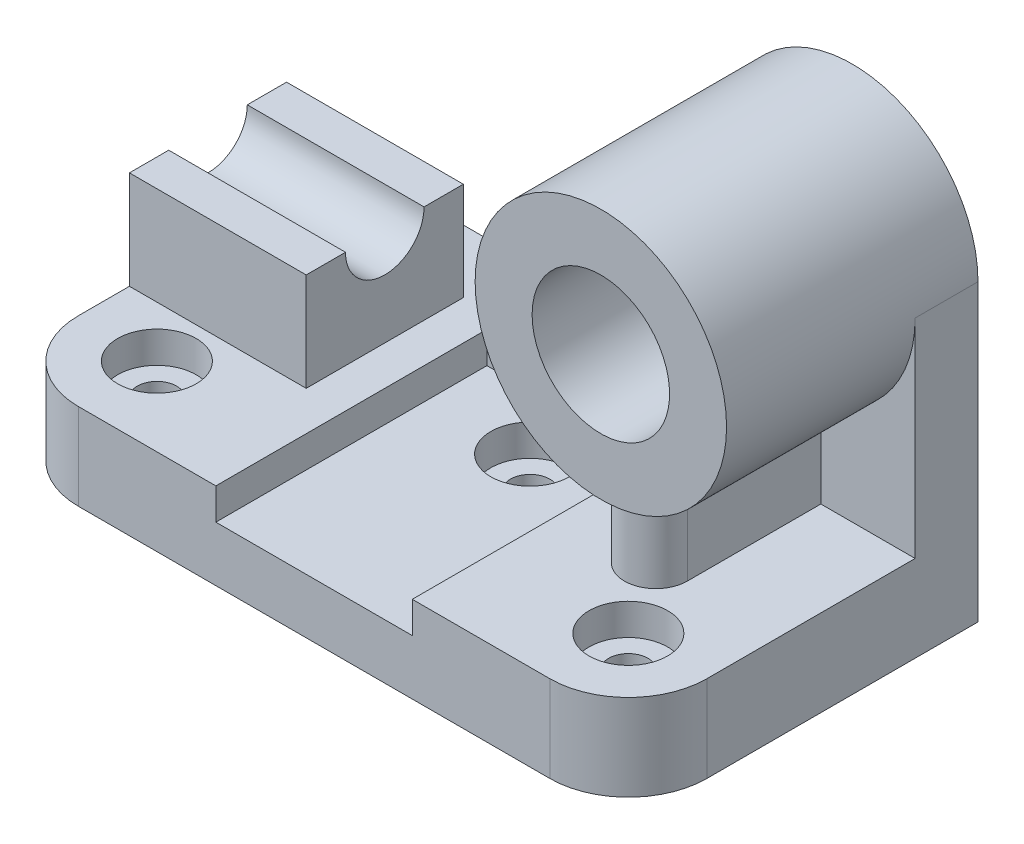
ISO-10303-21;
HEADER;
FILE_DESCRIPTION(('STEP AP214'),'2;1');
FILE_NAME('part.step','',(''),(''),'','','');
FILE_SCHEMA(('AUTOMOTIVE_DESIGN { 1 0 10303 214 1 1 1 1 }'));
ENDSEC;
DATA;
#1=APPLICATION_CONTEXT('core data for automotive mechanical design processes');
#2=APPLICATION_PROTOCOL_DEFINITION('international standard','automotive_design',2000,#1);
#3=PRODUCT_CONTEXT('',#1,'mechanical');
#4=PRODUCT('Part','Part','',(#3));
#5=PRODUCT_RELATED_PRODUCT_CATEGORY('part','',(#4));
#6=PRODUCT_DEFINITION_FORMATION('','',#4);
#7=PRODUCT_DEFINITION_CONTEXT('part definition',#1,'design');
#8=PRODUCT_DEFINITION('design','',#6,#7);
#9=PRODUCT_DEFINITION_SHAPE('','',#8);
#10=(LENGTH_UNIT() NAMED_UNIT(*) SI_UNIT(.MILLI.,.METRE.));
#11=(NAMED_UNIT(*) PLANE_ANGLE_UNIT() SI_UNIT($,.RADIAN.));
#12=(NAMED_UNIT(*) SI_UNIT($,.STERADIAN.) SOLID_ANGLE_UNIT());
#13=UNCERTAINTY_MEASURE_WITH_UNIT(LENGTH_MEASURE(1.E-05),#10,'distance_accuracy_value','');
#14=(GEOMETRIC_REPRESENTATION_CONTEXT(3) GLOBAL_UNCERTAINTY_ASSIGNED_CONTEXT((#13)) GLOBAL_UNIT_ASSIGNED_CONTEXT((#10,
#11,#12)) REPRESENTATION_CONTEXT('',''));
#15=CARTESIAN_POINT('',(0.,0.,0.));
#16=DIRECTION('',(0.,0.,1.));
#17=DIRECTION('',(1.,0.,0.));
#18=AXIS2_PLACEMENT_3D('',#15,#16,#17);
#19=CARTESIAN_POINT('',(0.,47.,0.));
#20=DIRECTION('',(0.,-1.,0.));
#21=DIRECTION('',(0.,0.,-1.));
#22=AXIS2_PLACEMENT_3D('',#19,#20,#21);
#23=PLANE('',#22);
#24=DIRECTION('',(0.,0.,1.));
#25=VECTOR('',#24,1.);
#26=CARTESIAN_POINT('',(0.,47.,-33.));
#27=LINE('',#26,#25);
#28=CARTESIAN_POINT('',(0.,47.,-73.));
#29=VERTEX_POINT('',#28);
#30=CARTESIAN_POINT('',(0.,47.,-63.));
#31=VERTEX_POINT('',#30);
#32=EDGE_CURVE('E210',#29,#31,#27,.T.);
#33=ORIENTED_EDGE('',*,*,#32,.T.);
#34=DIRECTION('',(1.,0.,0.));
#35=VECTOR('',#34,1.);
#36=CARTESIAN_POINT('',(45.,47.,-63.));
#37=LINE('',#36,#35);
#38=CARTESIAN_POINT('',(45.,47.,-63.));
#39=VERTEX_POINT('',#38);
#40=EDGE_CURVE('E13',#31,#39,#37,.T.);
#41=ORIENTED_EDGE('',*,*,#40,.T.);
#42=DIRECTION('',(0.,0.,-1.));
#43=VECTOR('',#42,1.);
#44=CARTESIAN_POINT('',(45.,47.,-73.));
#45=LINE('',#44,#43);
#46=CARTESIAN_POINT('',(45.,47.,-73.));
#47=VERTEX_POINT('',#46);
#48=EDGE_CURVE('E207',#39,#47,#45,.T.);
#49=ORIENTED_EDGE('',*,*,#48,.T.);
#50=DIRECTION('',(-1.,0.,0.));
#51=VECTOR('',#50,1.);
#52=CARTESIAN_POINT('',(0.,47.,-73.));
#53=LINE('',#52,#51);
#54=EDGE_CURVE('E218',#47,#29,#53,.T.);
#55=ORIENTED_EDGE('',*,*,#54,.T.);
#56=EDGE_LOOP('',(#33,#41,#49,#55));
#57=FACE_BOUND('',#56,.T.);
#58=ADVANCED_FACE('F44',(#57),#23,.F.);
#59=CARTESIAN_POINT('',(20.,22.,-20.));
#60=DIRECTION('',(0.,1.,0.));
#61=DIRECTION('',(0.,0.,1.));
#62=AXIS2_PLACEMENT_3D('',#59,#60,#61);
#63=PLANE('',#62);
#64=CARTESIAN_POINT('',(20.,22.,-20.));
#65=DIRECTION('',(0.,1.,0.));
#66=DIRECTION('',(0.,0.,1.));
#67=AXIS2_PLACEMENT_3D('',#64,#65,#66);
#68=CIRCLE('',#67,10.);
#69=CARTESIAN_POINT('',(20.,22.,-10.));
#70=VERTEX_POINT('',#69);
#71=EDGE_CURVE('E452',#70,#70,#68,.T.);
#72=ORIENTED_EDGE('',*,*,#71,.F.);
#73=EDGE_LOOP('',(#72));
#74=FACE_BOUND('',#73,.T.);
#75=CARTESIAN_POINT('',(140.,22.,-20.));
#76=DIRECTION('',(0.,1.,0.));
#77=DIRECTION('',(0.,0.,1.));
#78=AXIS2_PLACEMENT_3D('',#75,#76,#77);
#79=CIRCLE('',#78,10.);
#80=CARTESIAN_POINT('',(140.,22.,-9.99999999999999));
#81=VERTEX_POINT('',#80);
#82=EDGE_CURVE('E458',#81,#81,#79,.T.);
#83=ORIENTED_EDGE('',*,*,#82,.F.);
#84=EDGE_LOOP('',(#83));
#85=FACE_BOUND('',#84,.T.);
#86=DIRECTION('',(0.,0.,-1.));
#87=VECTOR('',#86,1.);
#88=CARTESIAN_POINT('',(45.,22.,-73.));
#89=LINE('',#88,#87);
#90=CARTESIAN_POINT('',(45.,22.,-33.));
#91=VERTEX_POINT('',#90);
#92=CARTESIAN_POINT('',(45.,22.,-73.));
#93=VERTEX_POINT('',#92);
#94=EDGE_CURVE('E67',#91,#93,#89,.T.);
#95=ORIENTED_EDGE('',*,*,#94,.F.);
#96=DIRECTION('',(1.,0.,0.));
#97=VECTOR('',#96,1.);
#98=CARTESIAN_POINT('',(45.,22.,-33.));
#99=LINE('',#98,#97);
#100=CARTESIAN_POINT('',(0.,22.,-33.));
#101=VERTEX_POINT('',#100);
#102=EDGE_CURVE('E224',#101,#91,#99,.T.);
#103=ORIENTED_EDGE('',*,*,#102,.F.);
#104=DIRECTION('',(0.,0.,1.));
#105=VECTOR('',#104,1.);
#106=CARTESIAN_POINT('',(0.,22.,-89.));
#107=LINE('',#106,#105);
#108=CARTESIAN_POINT('',(0.,22.,-20.));
#109=VERTEX_POINT('',#108);
#110=EDGE_CURVE('E368',#101,#109,#107,.T.);
#111=ORIENTED_EDGE('',*,*,#110,.T.);
#112=CARTESIAN_POINT('',(20.,22.,-20.));
#113=DIRECTION('',(0.,1.,0.));
#114=DIRECTION('',(0.,0.,1.));
#115=AXIS2_PLACEMENT_3D('',#112,#113,#114);
#116=CIRCLE('',#115,20.);
#117=CARTESIAN_POINT('',(20.,22.,0.));
#118=VERTEX_POINT('',#117);
#119=EDGE_CURVE('E372',#109,#118,#116,.T.);
#120=ORIENTED_EDGE('',*,*,#119,.T.);
#121=DIRECTION('',(1.,0.,0.));
#122=VECTOR('',#121,1.);
#123=CARTESIAN_POINT('',(20.,22.,0.));
#124=LINE('',#123,#122);
#125=CARTESIAN_POINT('',(55.,22.,0.));
#126=VERTEX_POINT('',#125);
#127=EDGE_CURVE('E393',#118,#126,#124,.T.);
#128=ORIENTED_EDGE('',*,*,#127,.T.);
#129=DIRECTION('',(0.,0.,1.));
#130=VECTOR('',#129,1.);
#131=CARTESIAN_POINT('',(55.,22.,0.));
#132=LINE('',#131,#130);
#133=CARTESIAN_POINT('',(55.,22.,-69.));
#134=VERTEX_POINT('',#133);
#135=EDGE_CURVE('E466',#134,#126,#132,.T.);
#136=ORIENTED_EDGE('',*,*,#135,.F.);
#137=DIRECTION('',(-1.,0.,0.));
#138=VECTOR('',#137,1.);
#139=CARTESIAN_POINT('',(55.,22.,-69.));
#140=LINE('',#139,#138);
#141=CARTESIAN_POINT('',(105.,22.,-69.));
#142=VERTEX_POINT('',#141);
#143=EDGE_CURVE('E441',#142,#134,#140,.T.);
#144=ORIENTED_EDGE('',*,*,#143,.F.);
#145=DIRECTION('',(0.,0.,-1.));
#146=VECTOR('',#145,1.);
#147=CARTESIAN_POINT('',(105.,22.,-69.));
#148=LINE('',#147,#146);
#149=CARTESIAN_POINT('',(105.,22.,0.));
#150=VERTEX_POINT('',#149);
#151=EDGE_CURVE('E436',#150,#142,#148,.T.);
#152=ORIENTED_EDGE('',*,*,#151,.F.);
#153=CARTESIAN_POINT('',(140.,22.,0.));
#154=VERTEX_POINT('',#153);
#155=EDGE_CURVE('E391',#150,#154,#124,.T.);
#156=ORIENTED_EDGE('',*,*,#155,.T.);
#157=CARTESIAN_POINT('',(140.,22.,-20.));
#158=DIRECTION('',(0.,1.,0.));
#159=DIRECTION('',(0.,0.,1.));
#160=AXIS2_PLACEMENT_3D('',#157,#158,#159);
#161=CIRCLE('',#160,20.);
#162=CARTESIAN_POINT('',(160.,22.,-20.));
#163=VERTEX_POINT('',#162);
#164=EDGE_CURVE('E401',#154,#163,#161,.T.);
#165=ORIENTED_EDGE('',*,*,#164,.T.);
#166=DIRECTION('',(0.,0.,-1.));
#167=VECTOR('',#166,1.);
#168=CARTESIAN_POINT('',(160.,22.,-20.));
#169=LINE('',#168,#167);
#170=CARTESIAN_POINT('',(160.,22.,-73.));
#171=VERTEX_POINT('',#170);
#172=EDGE_CURVE('E403',#163,#171,#169,.T.);
#173=ORIENTED_EDGE('',*,*,#172,.T.);
#174=DIRECTION('',(1.,0.,0.));
#175=VECTOR('',#174,1.);
#176=CARTESIAN_POINT('',(136.,22.,-73.));
#177=LINE('',#176,#175);
#178=CARTESIAN_POINT('',(136.,22.,-73.));
#179=VERTEX_POINT('',#178);
#180=EDGE_CURVE('E253',#179,#171,#177,.T.);
#181=ORIENTED_EDGE('',*,*,#180,.F.);
#182=DIRECTION('',(0.,0.,-1.));
#183=VECTOR('',#182,1.);
#184=CARTESIAN_POINT('',(136.,22.,-39.));
#185=LINE('',#184,#183);
#186=CARTESIAN_POINT('',(136.,22.,-39.));
#187=VERTEX_POINT('',#186);
#188=EDGE_CURVE('E256',#187,#179,#185,.T.);
#189=ORIENTED_EDGE('',*,*,#188,.F.);
#190=CARTESIAN_POINT('',(128.,22.,-39.));
#191=DIRECTION('',(0.,1.,0.));
#192=DIRECTION('',(0.,0.,1.));
#193=AXIS2_PLACEMENT_3D('',#190,#191,#192);
#194=CIRCLE('',#193,8.00000000000001);
#195=CARTESIAN_POINT('',(120.,22.,-39.));
#196=VERTEX_POINT('',#195);
#197=EDGE_CURVE('E260',#196,#187,#194,.T.);
#198=ORIENTED_EDGE('',*,*,#197,.F.);
#199=DIRECTION('',(0.,0.,1.));
#200=VECTOR('',#199,1.);
#201=CARTESIAN_POINT('',(120.,22.,-73.));
#202=LINE('',#201,#200);
#203=CARTESIAN_POINT('',(120.,22.,-73.));
#204=VERTEX_POINT('',#203);
#205=EDGE_CURVE('E263',#204,#196,#202,.T.);
#206=ORIENTED_EDGE('',*,*,#205,.F.);
#207=DIRECTION('',(1.,0.,0.));
#208=VECTOR('',#207,1.);
#209=CARTESIAN_POINT('',(96.,22.,-73.));
#210=LINE('',#209,#208);
#211=CARTESIAN_POINT('',(96.,22.,-73.));
#212=VERTEX_POINT('',#211);
#213=EDGE_CURVE('E266',#212,#204,#210,.T.);
#214=ORIENTED_EDGE('',*,*,#213,.F.);
#215=DIRECTION('',(0.,0.,1.));
#216=VECTOR('',#215,1.);
#217=CARTESIAN_POINT('',(96.,22.,-89.));
#218=LINE('',#217,#216);
#219=CARTESIAN_POINT('',(96.,22.,-89.));
#220=VERTEX_POINT('',#219);
#221=EDGE_CURVE('E269',#220,#212,#218,.T.);
#222=ORIENTED_EDGE('',*,*,#221,.F.);
#223=DIRECTION('',(-1.,0.,0.));
#224=VECTOR('',#223,1.);
#225=CARTESIAN_POINT('',(160.,22.,-89.));
#226=LINE('',#225,#224);
#227=CARTESIAN_POINT('',(0.,22.,-89.));
#228=VERTEX_POINT('',#227);
#229=EDGE_CURVE('E376',#220,#228,#226,.T.);
#230=ORIENTED_EDGE('',*,*,#229,.T.);
#231=CARTESIAN_POINT('',(0.,22.,-73.));
#232=VERTEX_POINT('',#231);
#233=EDGE_CURVE('E375',#228,#232,#107,.T.);
#234=ORIENTED_EDGE('',*,*,#233,.T.);
#235=DIRECTION('',(-1.,0.,0.));
#236=VECTOR('',#235,1.);
#237=CARTESIAN_POINT('',(0.,22.,-73.));
#238=LINE('',#237,#236);
#239=EDGE_CURVE('E227',#93,#232,#238,.T.);
#240=ORIENTED_EDGE('',*,*,#239,.F.);
#241=EDGE_LOOP('',(#95,#103,#111,#120,#128,#136,#144,#152,#156,#165,#173,#181,#189,#198,#206,
#214,#222,#230,#234,#240));
#242=FACE_BOUND('',#241,.T.);
#243=ADVANCED_FACE('F342',(#74,#85,#242),#63,.T.);
#244=CARTESIAN_POINT('',(80.,22.,-55.));
#245=DIRECTION('',(0.,-1.,0.));
#246=DIRECTION('',(0.,0.,-1.));
#247=AXIS2_PLACEMENT_3D('',#244,#245,#246);
#248=CYLINDRICAL_SURFACE('',#247,5.00000000000001);
#249=CARTESIAN_POINT('',(80.,0.,-55.));
#250=DIRECTION('',(0.,1.,0.));
#251=DIRECTION('',(0.,0.,1.));
#252=AXIS2_PLACEMENT_3D('',#249,#250,#251);
#253=CIRCLE('',#252,5.00000000000001);
#254=CARTESIAN_POINT('',(80.,0.,-50.));
#255=VERTEX_POINT('',#254);
#256=EDGE_CURVE('E433',#255,#255,#253,.T.);
#257=ORIENTED_EDGE('',*,*,#256,.F.);
#258=EDGE_LOOP('',(#257));
#259=FACE_BOUND('',#258,.T.);
#260=CARTESIAN_POINT('',(80.,6.,-55.));
#261=DIRECTION('',(0.,1.,0.));
#262=DIRECTION('',(0.,0.,1.));
#263=AXIS2_PLACEMENT_3D('',#260,#261,#262);
#264=CIRCLE('',#263,5.00000000000001);
#265=CARTESIAN_POINT('',(80.,6.,-50.));
#266=VERTEX_POINT('',#265);
#267=EDGE_CURVE('E434',#266,#266,#264,.T.);
#268=ORIENTED_EDGE('',*,*,#267,.T.);
#269=EDGE_LOOP('',(#268));
#270=FACE_BOUND('',#269,.T.);
#271=ADVANCED_FACE('F348',(#259,#270),#248,.F.);
#272=CARTESIAN_POINT('',(20.,22.,-20.));
#273=DIRECTION('',(0.,-1.,0.));
#274=DIRECTION('',(0.,0.,-1.));
#275=AXIS2_PLACEMENT_3D('',#272,#273,#274);
#276=CYLINDRICAL_SURFACE('',#275,5.);
#277=CARTESIAN_POINT('',(20.,0.,-20.));
#278=DIRECTION('',(0.,1.,0.));
#279=DIRECTION('',(0.,0.,1.));
#280=AXIS2_PLACEMENT_3D('',#277,#278,#279);
#281=CIRCLE('',#280,5.);
#282=CARTESIAN_POINT('',(20.,0.,-15.));
#283=VERTEX_POINT('',#282);
#284=EDGE_CURVE('E398',#283,#283,#281,.T.);
#285=ORIENTED_EDGE('',*,*,#284,.F.);
#286=EDGE_LOOP('',(#285));
#287=FACE_BOUND('',#286,.T.);
#288=CARTESIAN_POINT('',(20.,14.,-20.));
#289=DIRECTION('',(0.,1.,0.));
#290=DIRECTION('',(0.,0.,1.));
#291=AXIS2_PLACEMENT_3D('',#288,#289,#290);
#292=CIRCLE('',#291,5.);
#293=CARTESIAN_POINT('',(20.,14.,-15.));
#294=VERTEX_POINT('',#293);
#295=EDGE_CURVE('E429',#294,#294,#292,.T.);
#296=ORIENTED_EDGE('',*,*,#295,.T.);
#297=EDGE_LOOP('',(#296));
#298=FACE_BOUND('',#297,.T.);
#299=ADVANCED_FACE('F495',(#287,#298),#276,.F.);
#300=CARTESIAN_POINT('',(140.,22.,-20.));
#301=DIRECTION('',(0.,-1.,0.));
#302=DIRECTION('',(0.,0.,-1.));
#303=AXIS2_PLACEMENT_3D('',#300,#301,#302);
#304=CYLINDRICAL_SURFACE('',#303,4.99999999999999);
#305=CARTESIAN_POINT('',(140.,0.,-20.));
#306=DIRECTION('',(0.,1.,0.));
#307=DIRECTION('',(0.,0.,1.));
#308=AXIS2_PLACEMENT_3D('',#305,#306,#307);
#309=CIRCLE('',#308,4.99999999999999);
#310=CARTESIAN_POINT('',(140.,0.,-15.));
#311=VERTEX_POINT('',#310);
#312=EDGE_CURVE('E486',#311,#311,#309,.T.);
#313=ORIENTED_EDGE('',*,*,#312,.F.);
#314=EDGE_LOOP('',(#313));
#315=FACE_BOUND('',#314,.T.);
#316=CARTESIAN_POINT('',(140.,14.,-20.));
#317=DIRECTION('',(0.,1.,0.));
#318=DIRECTION('',(0.,0.,1.));
#319=AXIS2_PLACEMENT_3D('',#316,#317,#318);
#320=CIRCLE('',#319,4.99999999999999);
#321=CARTESIAN_POINT('',(140.,14.,-15.));
#322=VERTEX_POINT('',#321);
#323=EDGE_CURVE('E426',#322,#322,#320,.T.);
#324=ORIENTED_EDGE('',*,*,#323,.T.);
#325=EDGE_LOOP('',(#324));
#326=FACE_BOUND('',#325,.T.);
#327=ADVANCED_FACE('F498',(#315,#326),#304,.F.);
#328=CARTESIAN_POINT('',(20.,0.,-20.));
#329=DIRECTION('',(0.,1.,0.));
#330=DIRECTION('',(0.,0.,1.));
#331=AXIS2_PLACEMENT_3D('',#328,#329,#330);
#332=PLANE('',#331);
#333=CARTESIAN_POINT('',(20.,0.,-20.));
#334=DIRECTION('',(0.,1.,0.));
#335=DIRECTION('',(0.,0.,1.));
#336=AXIS2_PLACEMENT_3D('',#333,#334,#335);
#337=CIRCLE('',#336,20.);
#338=CARTESIAN_POINT('',(0.,0.,-20.));
#339=VERTEX_POINT('',#338);
#340=CARTESIAN_POINT('',(20.,0.,0.));
#341=VERTEX_POINT('',#340);
#342=EDGE_CURVE('E406',#339,#341,#337,.T.);
#343=ORIENTED_EDGE('',*,*,#342,.F.);
#344=DIRECTION('',(0.,0.,1.));
#345=VECTOR('',#344,1.);
#346=CARTESIAN_POINT('',(0.,0.,-89.));
#347=LINE('',#346,#345);
#348=CARTESIAN_POINT('',(0.,0.,-89.));
#349=VERTEX_POINT('',#348);
#350=EDGE_CURVE('E383',#349,#339,#347,.T.);
#351=ORIENTED_EDGE('',*,*,#350,.F.);
#352=DIRECTION('',(-1.,0.,0.));
#353=VECTOR('',#352,1.);
#354=CARTESIAN_POINT('',(160.,0.,-89.));
#355=LINE('',#354,#353);
#356=CARTESIAN_POINT('',(160.,0.,-89.));
#357=VERTEX_POINT('',#356);
#358=EDGE_CURVE('E395',#357,#349,#355,.T.);
#359=ORIENTED_EDGE('',*,*,#358,.F.);
#360=DIRECTION('',(0.,0.,-1.));
#361=VECTOR('',#360,1.);
#362=CARTESIAN_POINT('',(160.,0.,-20.));
#363=LINE('',#362,#361);
#364=CARTESIAN_POINT('',(160.,0.,-20.));
#365=VERTEX_POINT('',#364);
#366=EDGE_CURVE('E412',#365,#357,#363,.T.);
#367=ORIENTED_EDGE('',*,*,#366,.F.);
#368=CARTESIAN_POINT('',(140.,0.,-20.));
#369=DIRECTION('',(0.,1.,0.));
#370=DIRECTION('',(0.,0.,1.));
#371=AXIS2_PLACEMENT_3D('',#368,#369,#370);
#372=CIRCLE('',#371,20.);
#373=CARTESIAN_POINT('',(140.,0.,0.));
#374=VERTEX_POINT('',#373);
#375=EDGE_CURVE('E410',#374,#365,#372,.T.);
#376=ORIENTED_EDGE('',*,*,#375,.F.);
#377=DIRECTION('',(1.,0.,0.));
#378=VECTOR('',#377,1.);
#379=CARTESIAN_POINT('',(20.,0.,0.));
#380=LINE('',#379,#378);
#381=EDGE_CURVE('E408',#341,#374,#380,.T.);
#382=ORIENTED_EDGE('',*,*,#381,.F.);
#383=EDGE_LOOP('',(#343,#351,#359,#367,#376,#382));
#384=FACE_BOUND('',#383,.T.);
#385=ORIENTED_EDGE('',*,*,#284,.T.);
#386=EDGE_LOOP('',(#385));
#387=FACE_BOUND('',#386,.T.);
#388=ORIENTED_EDGE('',*,*,#312,.T.);
#389=EDGE_LOOP('',(#388));
#390=FACE_BOUND('',#389,.T.);
#391=ORIENTED_EDGE('',*,*,#256,.T.);
#392=EDGE_LOOP('',(#391));
#393=FACE_BOUND('',#392,.T.);
#394=ADVANCED_FACE('F493',(#384,#387,#390,#393),#332,.F.);
#395=CARTESIAN_POINT('',(20.,22.,-20.));
#396=DIRECTION('',(0.,-1.,0.));
#397=DIRECTION('',(0.,0.,-1.));
#398=AXIS2_PLACEMENT_3D('',#395,#396,#397);
#399=CYLINDRICAL_SURFACE('',#398,20.);
#400=ORIENTED_EDGE('',*,*,#342,.T.);
#401=DIRECTION('',(0.,-1.,0.));
#402=VECTOR('',#401,1.);
#403=CARTESIAN_POINT('',(20.,22.,0.));
#404=LINE('',#403,#402);
#405=EDGE_CURVE('E390',#118,#341,#404,.T.);
#406=ORIENTED_EDGE('',*,*,#405,.F.);
#407=ORIENTED_EDGE('',*,*,#119,.F.);
#408=DIRECTION('',(0.,-1.,0.));
#409=VECTOR('',#408,1.);
#410=CARTESIAN_POINT('',(0.,22.,-20.));
#411=LINE('',#410,#409);
#412=EDGE_CURVE('E379',#109,#339,#411,.T.);
#413=ORIENTED_EDGE('',*,*,#412,.T.);
#414=EDGE_LOOP('',(#400,#406,#407,#413));
#415=FACE_BOUND('',#414,.T.);
#416=ADVANCED_FACE('F46',(#415),#399,.T.);
#417=CARTESIAN_POINT('',(20.,22.,0.));
#418=DIRECTION('',(0.,0.,-1.));
#419=DIRECTION('',(-1.,0.,0.));
#420=AXIS2_PLACEMENT_3D('',#417,#418,#419);
#421=PLANE('',#420);
#422=DIRECTION('',(1.,0.,0.));
#423=VECTOR('',#422,1.);
#424=CARTESIAN_POINT('',(105.,14.,0.));
#425=LINE('',#424,#423);
#426=CARTESIAN_POINT('',(55.,14.,0.));
#427=VERTEX_POINT('',#426);
#428=CARTESIAN_POINT('',(105.,14.,0.));
#429=VERTEX_POINT('',#428);
#430=EDGE_CURVE('E462',#427,#429,#425,.T.);
#431=ORIENTED_EDGE('',*,*,#430,.F.);
#432=DIRECTION('',(0.,1.,0.));
#433=VECTOR('',#432,1.);
#434=CARTESIAN_POINT('',(55.,14.,0.));
#435=LINE('',#434,#433);
#436=EDGE_CURVE('E461',#427,#126,#435,.T.);
#437=ORIENTED_EDGE('',*,*,#436,.T.);
#438=ORIENTED_EDGE('',*,*,#127,.F.);
#439=ORIENTED_EDGE('',*,*,#405,.T.);
#440=ORIENTED_EDGE('',*,*,#381,.T.);
#441=DIRECTION('',(0.,-1.,0.));
#442=VECTOR('',#441,1.);
#443=CARTESIAN_POINT('',(140.,22.,0.));
#444=LINE('',#443,#442);
#445=EDGE_CURVE('E422',#154,#374,#444,.T.);
#446=ORIENTED_EDGE('',*,*,#445,.F.);
#447=ORIENTED_EDGE('',*,*,#155,.F.);
#448=DIRECTION('',(0.,1.,0.));
#449=VECTOR('',#448,1.);
#450=CARTESIAN_POINT('',(105.,14.,0.));
#451=LINE('',#450,#449);
#452=EDGE_CURVE('E473',#429,#150,#451,.T.);
#453=ORIENTED_EDGE('',*,*,#452,.F.);
#454=EDGE_LOOP('',(#431,#437,#438,#439,#440,#446,#447,#453));
#455=FACE_BOUND('',#454,.T.);
#456=ADVANCED_FACE('F566',(#455),#421,.F.);
#457=CARTESIAN_POINT('',(140.,22.,-20.));
#458=DIRECTION('',(0.,-1.,0.));
#459=DIRECTION('',(0.,0.,-1.));
#460=AXIS2_PLACEMENT_3D('',#457,#458,#459);
#461=CYLINDRICAL_SURFACE('',#460,20.);
#462=ORIENTED_EDGE('',*,*,#375,.T.);
#463=DIRECTION('',(0.,-1.,0.));
#464=VECTOR('',#463,1.);
#465=CARTESIAN_POINT('',(160.,22.,-20.));
#466=LINE('',#465,#464);
#467=EDGE_CURVE('E419',#163,#365,#466,.T.);
#468=ORIENTED_EDGE('',*,*,#467,.F.);
#469=ORIENTED_EDGE('',*,*,#164,.F.);
#470=ORIENTED_EDGE('',*,*,#445,.T.);
#471=EDGE_LOOP('',(#462,#468,#469,#470));
#472=FACE_BOUND('',#471,.T.);
#473=ADVANCED_FACE('F563',(#472),#461,.T.);
#474=CARTESIAN_POINT('',(160.,22.,-20.));
#475=DIRECTION('',(-1.,0.,0.));
#476=DIRECTION('',(0.,0.,1.));
#477=AXIS2_PLACEMENT_3D('',#474,#475,#476);
#478=PLANE('',#477);
#479=ORIENTED_EDGE('',*,*,#366,.T.);
#480=DIRECTION('',(0.,-1.,0.));
#481=VECTOR('',#480,1.);
#482=CARTESIAN_POINT('',(160.,22.,-89.));
#483=LINE('',#482,#481);
#484=CARTESIAN_POINT('',(160.,75.,-89.));
#485=VERTEX_POINT('',#484);
#486=EDGE_CURVE('E416',#485,#357,#483,.T.);
#487=ORIENTED_EDGE('',*,*,#486,.F.);
#488=DIRECTION('',(0.,0.,-1.));
#489=VECTOR('',#488,1.);
#490=CARTESIAN_POINT('',(160.,75.,-107.397420406071));
#491=LINE('',#490,#489);
#492=CARTESIAN_POINT('',(160.,75.,-73.));
#493=VERTEX_POINT('',#492);
#494=EDGE_CURVE('E273',#485,#493,#491,.F.);
#495=ORIENTED_EDGE('',*,*,#494,.T.);
#496=DIRECTION('',(0.,-1.,0.));
#497=VECTOR('',#496,1.);
#498=CARTESIAN_POINT('',(160.,107.002,-73.));
#499=LINE('',#498,#497);
#500=EDGE_CURVE('E257',#493,#171,#499,.T.);
#501=ORIENTED_EDGE('',*,*,#500,.T.);
#502=ORIENTED_EDGE('',*,*,#172,.F.);
#503=ORIENTED_EDGE('',*,*,#467,.T.);
#504=EDGE_LOOP('',(#479,#487,#495,#501,#502,#503));
#505=FACE_BOUND('',#504,.T.);
#506=ADVANCED_FACE('F559',(#505),#478,.F.);
#507=CARTESIAN_POINT('',(160.,22.,-89.));
#508=DIRECTION('',(0.,0.,1.));
#509=DIRECTION('',(1.,0.,0.));
#510=AXIS2_PLACEMENT_3D('',#507,#508,#509);
#511=PLANE('',#510);
#512=ORIENTED_EDGE('',*,*,#358,.T.);
#513=DIRECTION('',(0.,-1.,0.));
#514=VECTOR('',#513,1.);
#515=CARTESIAN_POINT('',(0.,22.,-89.));
#516=LINE('',#515,#514);
#517=EDGE_CURVE('E387',#228,#349,#516,.T.);
#518=ORIENTED_EDGE('',*,*,#517,.F.);
#519=ORIENTED_EDGE('',*,*,#229,.F.);
#520=DIRECTION('',(0.,-1.,0.));
#521=VECTOR('',#520,1.);
#522=CARTESIAN_POINT('',(96.,107.002,-89.));
#523=LINE('',#522,#521);
#524=CARTESIAN_POINT('',(96.,75.,-89.));
#525=VERTEX_POINT('',#524);
#526=EDGE_CURVE('E276',#525,#220,#523,.T.);
#527=ORIENTED_EDGE('',*,*,#526,.F.);
#528=CARTESIAN_POINT('',(128.,75.,-89.));
#529=DIRECTION('',(0.,0.,-1.));
#530=DIRECTION('',(-1.,0.,0.));
#531=AXIS2_PLACEMENT_3D('',#528,#529,#530);
#532=CIRCLE('',#531,32.);
#533=EDGE_CURVE('E249',#525,#485,#532,.T.);
#534=ORIENTED_EDGE('',*,*,#533,.T.);
#535=ORIENTED_EDGE('',*,*,#486,.T.);
#536=EDGE_LOOP('',(#512,#518,#519,#527,#534,#535));
#537=FACE_BOUND('',#536,.T.);
#538=CARTESIAN_POINT('',(128.,75.,-89.));
#539=DIRECTION('',(0.,0.,-1.));
#540=DIRECTION('',(-1.,0.,0.));
#541=AXIS2_PLACEMENT_3D('',#538,#539,#540);
#542=CIRCLE('',#541,17.5);
#543=CARTESIAN_POINT('',(110.5,75.,-89.));
#544=VERTEX_POINT('',#543);
#545=EDGE_CURVE('E246',#544,#544,#542,.T.);
#546=ORIENTED_EDGE('',*,*,#545,.F.);
#547=EDGE_LOOP('',(#546));
#548=FACE_BOUND('',#547,.T.);
#549=ADVANCED_FACE('F556',(#537,#548),#511,.F.);
#550=CARTESIAN_POINT('',(0.,22.,-89.));
#551=DIRECTION('',(1.,0.,0.));
#552=DIRECTION('',(0.,0.,-1.));
#553=AXIS2_PLACEMENT_3D('',#550,#551,#552);
#554=PLANE('',#553);
#555=CARTESIAN_POINT('',(0.,47.,-43.));
#556=VERTEX_POINT('',#555);
#557=CARTESIAN_POINT('',(0.,47.,-33.));
#558=VERTEX_POINT('',#557);
#559=EDGE_CURVE('E230',#556,#558,#27,.T.);
#560=ORIENTED_EDGE('',*,*,#559,.F.);
#561=CARTESIAN_POINT('',(0.,47.,-53.));
#562=DIRECTION('',(1.,0.,0.));
#563=DIRECTION('',(0.,0.,-1.));
#564=AXIS2_PLACEMENT_3D('',#561,#562,#563);
#565=CIRCLE('',#564,9.99999999999999);
#566=EDGE_CURVE('E59',#556,#31,#565,.T.);
#567=ORIENTED_EDGE('',*,*,#566,.T.);
#568=ORIENTED_EDGE('',*,*,#32,.F.);
#569=DIRECTION('',(0.,-1.,0.));
#570=VECTOR('',#569,1.);
#571=CARTESIAN_POINT('',(0.,47.,-73.));
#572=LINE('',#571,#570);
#573=EDGE_CURVE('E223',#29,#232,#572,.T.);
#574=ORIENTED_EDGE('',*,*,#573,.T.);
#575=ORIENTED_EDGE('',*,*,#233,.F.);
#576=ORIENTED_EDGE('',*,*,#517,.T.);
#577=ORIENTED_EDGE('',*,*,#350,.T.);
#578=ORIENTED_EDGE('',*,*,#412,.F.);
#579=ORIENTED_EDGE('',*,*,#110,.F.);
#580=DIRECTION('',(0.,-1.,0.));
#581=VECTOR('',#580,1.);
#582=CARTESIAN_POINT('',(0.,47.,-33.));
#583=LINE('',#582,#581);
#584=EDGE_CURVE('E237',#558,#101,#583,.T.);
#585=ORIENTED_EDGE('',*,*,#584,.F.);
#586=EDGE_LOOP('',(#560,#567,#568,#574,#575,#576,#577,#578,#579,#585));
#587=FACE_BOUND('',#586,.T.);
#588=ADVANCED_FACE('F380',(#587),#554,.F.);
#589=CARTESIAN_POINT('',(55.,14.,0.));
#590=DIRECTION('',(-1.,0.,0.));
#591=DIRECTION('',(0.,0.,1.));
#592=AXIS2_PLACEMENT_3D('',#589,#590,#591);
#593=PLANE('',#592);
#594=ORIENTED_EDGE('',*,*,#135,.T.);
#595=ORIENTED_EDGE('',*,*,#436,.F.);
#596=DIRECTION('',(0.,0.,1.));
#597=VECTOR('',#596,1.);
#598=CARTESIAN_POINT('',(55.,14.,0.));
#599=LINE('',#598,#597);
#600=CARTESIAN_POINT('',(55.,14.,-69.));
#601=VERTEX_POINT('',#600);
#602=EDGE_CURVE('E472',#601,#427,#599,.T.);
#603=ORIENTED_EDGE('',*,*,#602,.F.);
#604=DIRECTION('',(0.,1.,0.));
#605=VECTOR('',#604,1.);
#606=CARTESIAN_POINT('',(55.,14.,-69.));
#607=LINE('',#606,#605);
#608=EDGE_CURVE('E480',#601,#134,#607,.T.);
#609=ORIENTED_EDGE('',*,*,#608,.T.);
#610=EDGE_LOOP('',(#594,#595,#603,#609));
#611=FACE_BOUND('',#610,.T.);
#612=ADVANCED_FACE('F534',(#611),#593,.F.);
#613=CARTESIAN_POINT('',(55.,14.,-69.));
#614=DIRECTION('',(0.,0.,-1.));
#615=DIRECTION('',(-1.,0.,0.));
#616=AXIS2_PLACEMENT_3D('',#613,#614,#615);
#617=PLANE('',#616);
#618=ORIENTED_EDGE('',*,*,#143,.T.);
#619=ORIENTED_EDGE('',*,*,#608,.F.);
#620=DIRECTION('',(-1.,0.,0.));
#621=VECTOR('',#620,1.);
#622=CARTESIAN_POINT('',(55.,14.,-69.));
#623=LINE('',#622,#621);
#624=CARTESIAN_POINT('',(105.,14.,-69.));
#625=VERTEX_POINT('',#624);
#626=EDGE_CURVE('E469',#625,#601,#623,.T.);
#627=ORIENTED_EDGE('',*,*,#626,.F.);
#628=DIRECTION('',(0.,1.,0.));
#629=VECTOR('',#628,1.);
#630=CARTESIAN_POINT('',(105.,14.,-69.));
#631=LINE('',#630,#629);
#632=EDGE_CURVE('E482',#625,#142,#631,.T.);
#633=ORIENTED_EDGE('',*,*,#632,.T.);
#634=EDGE_LOOP('',(#618,#619,#627,#633));
#635=FACE_BOUND('',#634,.T.);
#636=ADVANCED_FACE('F537',(#635),#617,.F.);
#637=CARTESIAN_POINT('',(105.,14.,-69.));
#638=DIRECTION('',(1.,0.,0.));
#639=DIRECTION('',(0.,0.,-1.));
#640=AXIS2_PLACEMENT_3D('',#637,#638,#639);
#641=PLANE('',#640);
#642=ORIENTED_EDGE('',*,*,#151,.T.);
#643=ORIENTED_EDGE('',*,*,#632,.F.);
#644=DIRECTION('',(0.,0.,-1.));
#645=VECTOR('',#644,1.);
#646=CARTESIAN_POINT('',(105.,14.,-69.));
#647=LINE('',#646,#645);
#648=EDGE_CURVE('E465',#429,#625,#647,.T.);
#649=ORIENTED_EDGE('',*,*,#648,.F.);
#650=ORIENTED_EDGE('',*,*,#452,.T.);
#651=EDGE_LOOP('',(#642,#643,#649,#650));
#652=FACE_BOUND('',#651,.T.);
#653=ADVANCED_FACE('F529',(#652),#641,.F.);
#654=CARTESIAN_POINT('',(0.,14.,0.));
#655=DIRECTION('',(0.,-1.,0.));
#656=DIRECTION('',(0.,0.,-1.));
#657=AXIS2_PLACEMENT_3D('',#654,#655,#656);
#658=PLANE('',#657);
#659=CARTESIAN_POINT('',(80.,14.,-55.));
#660=DIRECTION('',(0.,1.,0.));
#661=DIRECTION('',(0.,0.,1.));
#662=AXIS2_PLACEMENT_3D('',#659,#660,#661);
#663=CIRCLE('',#662,9.99999999999999);
#664=CARTESIAN_POINT('',(80.,14.,-45.));
#665=VERTEX_POINT('',#664);
#666=EDGE_CURVE('E272',#665,#665,#663,.T.);
#667=ORIENTED_EDGE('',*,*,#666,.F.);
#668=EDGE_LOOP('',(#667));
#669=FACE_BOUND('',#668,.T.);
#670=ORIENTED_EDGE('',*,*,#430,.T.);
#671=ORIENTED_EDGE('',*,*,#648,.T.);
#672=ORIENTED_EDGE('',*,*,#626,.T.);
#673=ORIENTED_EDGE('',*,*,#602,.T.);
#674=EDGE_LOOP('',(#670,#671,#672,#673));
#675=FACE_BOUND('',#674,.T.);
#676=ADVANCED_FACE('F520',(#669,#675),#658,.F.);
#677=CARTESIAN_POINT('',(140.,14.,-20.));
#678=DIRECTION('',(0.,1.,0.));
#679=DIRECTION('',(0.,0.,1.));
#680=AXIS2_PLACEMENT_3D('',#677,#678,#679);
#681=CYLINDRICAL_SURFACE('',#680,10.);
#682=CARTESIAN_POINT('',(140.,14.,-20.));
#683=DIRECTION('',(0.,1.,0.));
#684=DIRECTION('',(0.,0.,1.));
#685=AXIS2_PLACEMENT_3D('',#682,#683,#684);
#686=CIRCLE('',#685,10.);
#687=CARTESIAN_POINT('',(140.,14.,-9.99999999999999));
#688=VERTEX_POINT('',#687);
#689=EDGE_CURVE('E455',#688,#688,#686,.T.);
#690=ORIENTED_EDGE('',*,*,#689,.F.);
#691=EDGE_LOOP('',(#690));
#692=FACE_BOUND('',#691,.T.);
#693=ORIENTED_EDGE('',*,*,#82,.T.);
#694=EDGE_LOOP('',(#693));
#695=FACE_BOUND('',#694,.T.);
#696=ADVANCED_FACE('F518',(#692,#695),#681,.F.);
#697=CARTESIAN_POINT('',(140.,14.,-20.));
#698=DIRECTION('',(0.,1.,0.));
#699=DIRECTION('',(0.,0.,1.));
#700=AXIS2_PLACEMENT_3D('',#697,#698,#699);
#701=PLANE('',#700);
#702=ORIENTED_EDGE('',*,*,#323,.F.);
#703=EDGE_LOOP('',(#702));
#704=FACE_BOUND('',#703,.T.);
#705=ORIENTED_EDGE('',*,*,#689,.T.);
#706=EDGE_LOOP('',(#705));
#707=FACE_BOUND('',#706,.T.);
#708=ADVANCED_FACE('F512',(#704,#707),#701,.T.);
#709=CARTESIAN_POINT('',(20.,14.,-20.));
#710=DIRECTION('',(0.,1.,0.));
#711=DIRECTION('',(0.,0.,1.));
#712=AXIS2_PLACEMENT_3D('',#709,#710,#711);
#713=CYLINDRICAL_SURFACE('',#712,10.);
#714=CARTESIAN_POINT('',(20.,14.,-20.));
#715=DIRECTION('',(0.,1.,0.));
#716=DIRECTION('',(0.,0.,1.));
#717=AXIS2_PLACEMENT_3D('',#714,#715,#716);
#718=CIRCLE('',#717,10.);
#719=CARTESIAN_POINT('',(20.,14.,-10.));
#720=VERTEX_POINT('',#719);
#721=EDGE_CURVE('E430',#720,#720,#718,.T.);
#722=ORIENTED_EDGE('',*,*,#721,.F.);
#723=EDGE_LOOP('',(#722));
#724=FACE_BOUND('',#723,.T.);
#725=ORIENTED_EDGE('',*,*,#71,.T.);
#726=EDGE_LOOP('',(#725));
#727=FACE_BOUND('',#726,.T.);
#728=ADVANCED_FACE('F506',(#724,#727),#713,.F.);
#729=CARTESIAN_POINT('',(20.,14.,-20.));
#730=DIRECTION('',(0.,1.,0.));
#731=DIRECTION('',(0.,0.,1.));
#732=AXIS2_PLACEMENT_3D('',#729,#730,#731);
#733=PLANE('',#732);
#734=ORIENTED_EDGE('',*,*,#295,.F.);
#735=EDGE_LOOP('',(#734));
#736=FACE_BOUND('',#735,.T.);
#737=ORIENTED_EDGE('',*,*,#721,.T.);
#738=EDGE_LOOP('',(#737));
#739=FACE_BOUND('',#738,.T.);
#740=ADVANCED_FACE('F502',(#736,#739),#733,.T.);
#741=CARTESIAN_POINT('',(80.,6.,-55.));
#742=DIRECTION('',(0.,1.,0.));
#743=DIRECTION('',(0.,0.,1.));
#744=AXIS2_PLACEMENT_3D('',#741,#742,#743);
#745=CYLINDRICAL_SURFACE('',#744,9.99999999999999);
#746=CARTESIAN_POINT('',(80.,6.,-55.));
#747=DIRECTION('',(0.,1.,0.));
#748=DIRECTION('',(0.,0.,1.));
#749=AXIS2_PLACEMENT_3D('',#746,#747,#748);
#750=CIRCLE('',#749,9.99999999999999);
#751=CARTESIAN_POINT('',(80.,6.,-45.));
#752=VERTEX_POINT('',#751);
#753=EDGE_CURVE('E437',#752,#752,#750,.T.);
#754=ORIENTED_EDGE('',*,*,#753,.F.);
#755=EDGE_LOOP('',(#754));
#756=FACE_BOUND('',#755,.T.);
#757=ORIENTED_EDGE('',*,*,#666,.T.);
#758=EDGE_LOOP('',(#757));
#759=FACE_BOUND('',#758,.T.);
#760=ADVANCED_FACE('F505',(#756,#759),#745,.F.);
#761=CARTESIAN_POINT('',(80.,6.,-55.));
#762=DIRECTION('',(0.,1.,0.));
#763=DIRECTION('',(0.,0.,1.));
#764=AXIS2_PLACEMENT_3D('',#761,#762,#763);
#765=PLANE('',#764);
#766=ORIENTED_EDGE('',*,*,#267,.F.);
#767=EDGE_LOOP('',(#766));
#768=FACE_BOUND('',#767,.T.);
#769=ORIENTED_EDGE('',*,*,#753,.T.);
#770=EDGE_LOOP('',(#769));
#771=FACE_BOUND('',#770,.T.);
#772=ADVANCED_FACE('F329',(#768,#771),#765,.T.);
#773=CARTESIAN_POINT('',(96.,107.002,-89.));
#774=DIRECTION('',(1.,0.,0.));
#775=DIRECTION('',(0.,0.,-1.));
#776=AXIS2_PLACEMENT_3D('',#773,#774,#775);
#777=PLANE('',#776);
#778=DIRECTION('',(0.,0.,-1.));
#779=VECTOR('',#778,1.);
#780=CARTESIAN_POINT('',(96.,75.,-107.397420406071));
#781=LINE('',#780,#779);
#782=CARTESIAN_POINT('',(96.,75.,-73.));
#783=VERTEX_POINT('',#782);
#784=EDGE_CURVE('E277',#525,#783,#781,.F.);
#785=ORIENTED_EDGE('',*,*,#784,.F.);
#786=ORIENTED_EDGE('',*,*,#526,.T.);
#787=ORIENTED_EDGE('',*,*,#221,.T.);
#788=DIRECTION('',(0.,-1.,0.));
#789=VECTOR('',#788,1.);
#790=CARTESIAN_POINT('',(96.,107.002,-73.));
#791=LINE('',#790,#789);
#792=EDGE_CURVE('E280',#783,#212,#791,.T.);
#793=ORIENTED_EDGE('',*,*,#792,.F.);
#794=EDGE_LOOP('',(#785,#786,#787,#793));
#795=FACE_BOUND('',#794,.T.);
#796=ADVANCED_FACE('F325',(#795),#777,.F.);
#797=CARTESIAN_POINT('',(96.,107.002,-73.));
#798=DIRECTION('',(0.,0.,-1.));
#799=DIRECTION('',(-1.,0.,0.));
#800=AXIS2_PLACEMENT_3D('',#797,#798,#799);
#801=PLANE('',#800);
#802=CARTESIAN_POINT('',(128.,75.,-73.));
#803=DIRECTION('',(0.,0.,-1.));
#804=DIRECTION('',(-1.,0.,0.));
#805=AXIS2_PLACEMENT_3D('',#802,#803,#804);
#806=CIRCLE('',#805,32.);
#807=CARTESIAN_POINT('',(120.,44.0161332303407,-73.));
#808=VERTEX_POINT('',#807);
#809=EDGE_CURVE('E299',#783,#808,#806,.F.);
#810=ORIENTED_EDGE('',*,*,#809,.F.);
#811=ORIENTED_EDGE('',*,*,#792,.T.);
#812=ORIENTED_EDGE('',*,*,#213,.T.);
#813=DIRECTION('',(0.,-1.,0.));
#814=VECTOR('',#813,1.);
#815=CARTESIAN_POINT('',(120.,107.002,-73.));
#816=LINE('',#815,#814);
#817=EDGE_CURVE('E283',#808,#204,#816,.T.);
#818=ORIENTED_EDGE('',*,*,#817,.F.);
#819=EDGE_LOOP('',(#810,#811,#812,#818));
#820=FACE_BOUND('',#819,.T.);
#821=ADVANCED_FACE('F328',(#820),#801,.F.);
#822=CARTESIAN_POINT('',(120.,107.002,-73.));
#823=DIRECTION('',(1.,0.,0.));
#824=DIRECTION('',(0.,0.,-1.));
#825=AXIS2_PLACEMENT_3D('',#822,#823,#824);
#826=PLANE('',#825);
#827=DIRECTION('',(0.,0.,-1.));
#828=VECTOR('',#827,1.);
#829=CARTESIAN_POINT('',(120.,44.0161332303407,-107.397420406071));
#830=LINE('',#829,#828);
#831=CARTESIAN_POINT('',(120.,44.0161332303407,-39.));
#832=VERTEX_POINT('',#831);
#833=EDGE_CURVE('E302',#808,#832,#830,.F.);
#834=ORIENTED_EDGE('',*,*,#833,.F.);
#835=ORIENTED_EDGE('',*,*,#817,.T.);
#836=ORIENTED_EDGE('',*,*,#205,.T.);
#837=DIRECTION('',(0.,-1.,0.));
#838=VECTOR('',#837,1.);
#839=CARTESIAN_POINT('',(120.,107.002,-39.));
#840=LINE('',#839,#838);
#841=EDGE_CURVE('E286',#832,#196,#840,.T.);
#842=ORIENTED_EDGE('',*,*,#841,.F.);
#843=EDGE_LOOP('',(#834,#835,#836,#842));
#844=FACE_BOUND('',#843,.T.);
#845=ADVANCED_FACE('F332',(#844),#826,.F.);
#846=CARTESIAN_POINT('',(128.,107.002,-39.));
#847=DIRECTION('',(0.,-1.,0.));
#848=DIRECTION('',(0.,0.,-1.));
#849=AXIS2_PLACEMENT_3D('',#846,#847,#848);
#850=CYLINDRICAL_SURFACE('',#849,8.00000000000001);
#851=CARTESIAN_POINT('',(120.,44.0161332303407,-39.));
#852=CARTESIAN_POINT('',(119.999971945566,44.0161587456746,-38.7787632793939));
#853=CARTESIAN_POINT('',(120.009176064831,44.0137645196395,-38.557535473152));
#854=CARTESIAN_POINT('',(120.045842310867,44.0043223033325,-38.1167341459232));
#855=CARTESIAN_POINT('',(120.073301365352,43.9972750961538,-37.8971603528554));
#856=CARTESIAN_POINT('',(120.146199191634,43.9787308558003,-37.4616585882652));
#857=CARTESIAN_POINT('',(120.191602336279,43.9672426410213,-37.2457242711686));
#858=CARTESIAN_POINT('',(120.300002890832,43.9401676916372,-36.8185811817318));
#859=CARTESIAN_POINT('',(120.363000542696,43.9245809006693,-36.6073724744208));
#860=CARTESIAN_POINT('',(120.506064323753,43.8897712214483,-36.191204452355));
#861=CARTESIAN_POINT('',(120.586125101168,43.8705494734963,-35.9862432010988));
#862=CARTESIAN_POINT('',(120.762745371193,43.8290139022865,-35.5837954015375));
#863=CARTESIAN_POINT('',(120.859310963568,43.8066989364312,-35.3863116498092));
#864=CARTESIAN_POINT('',(121.068219413401,43.7596114504408,-35.0001741347302));
#865=CARTESIAN_POINT('',(121.180562858629,43.7348388387613,-34.8115207006842));
#866=CARTESIAN_POINT('',(121.420246719391,43.68352091395,-34.4442414231035));
#867=CARTESIAN_POINT('',(121.547587799861,43.6569755222425,-34.2656160246922));
#868=CARTESIAN_POINT('',(121.819063644174,43.6022999736734,-33.9161090338005));
#869=CARTESIAN_POINT('',(121.963479658611,43.5741489065012,-33.7454491097791));
#870=CARTESIAN_POINT('',(122.266053298274,43.5175360184007,-33.4168340833016));
#871=CARTESIAN_POINT('',(122.424211093284,43.4890741936367,-33.258879137866));
#872=CARTESIAN_POINT('',(122.753260378166,43.432618312673,-32.9566872205935));
#873=CARTESIAN_POINT('',(122.924154062213,43.4046243380976,-32.8124526223269));
#874=CARTESIAN_POINT('',(123.277534787348,43.3498770188941,-32.5387095417601));
#875=CARTESIAN_POINT('',(123.46002151475,43.3231236407316,-32.4092006612744));
#876=CARTESIAN_POINT('',(123.838067466615,43.2712239960296,-32.1640813992573));
#877=CARTESIAN_POINT('',(124.033775424014,43.2461059150703,-32.048694268118));
#878=CARTESIAN_POINT('',(124.434486542919,43.1986195421176,-31.8348995954559));
#879=CARTESIAN_POINT('',(124.639486334742,43.1762502640207,-31.7364859597312));
#880=CARTESIAN_POINT('',(125.057417252549,43.1348890483568,-31.5573596954717));
#881=CARTESIAN_POINT('',(125.270348557584,43.1158971870896,-31.4766474668228));
#882=CARTESIAN_POINT('',(125.702600707962,43.0818398364785,-31.333594111353));
#883=CARTESIAN_POINT('',(125.921921404316,43.066774255662,-31.2712525565354));
#884=CARTESIAN_POINT('',(126.360837950093,43.0412689566384,-31.1665450539501));
#885=CARTESIAN_POINT('',(126.580338397818,43.0307417887522,-31.1238003648792));
#886=CARTESIAN_POINT('',(127.022311536688,43.0141746551767,-31.0568218767007));
#887=CARTESIAN_POINT('',(127.244784162794,43.0081345914602,-31.0325876732046));
#888=CARTESIAN_POINT('',(127.69103245733,43.0007135691066,-31.0028417489651));
#889=CARTESIAN_POINT('',(127.914807990918,42.9993321366233,-30.9973281240839));
#890=CARTESIAN_POINT('',(128.362012454294,43.0012665346051,-31.0050667288588));
#891=CARTESIAN_POINT('',(128.585441388351,43.0045823067546,-31.0183187255404));
#892=CARTESIAN_POINT('',(129.025299848157,43.015690144771,-31.0629646924678));
#893=CARTESIAN_POINT('',(129.24177403761,43.0233802543781,-31.0939455377458));
#894=CARTESIAN_POINT('',(129.671350605354,43.04295330281,-31.1734861779667));
#895=CARTESIAN_POINT('',(129.8844518186,43.0548376586974,-31.2220519142631));
#896=CARTESIAN_POINT('',(130.305662540343,43.0824741604892,-31.3363503165913));
#897=CARTESIAN_POINT('',(130.513773691212,43.0982250140932,-31.4020772472992));
#898=CARTESIAN_POINT('',(130.923753213755,43.1331831779633,-31.5502218929191));
#899=CARTESIAN_POINT('',(131.125619217958,43.1523917806589,-31.6326458502565));
#900=CARTESIAN_POINT('',(131.523424527648,43.1939341672797,-31.81433999981));
#901=CARTESIAN_POINT('',(131.71929718824,43.2162936282114,-31.9137501943813));
#902=CARTESIAN_POINT('',(132.102056502345,43.2634227888496,-32.1282260753892));
#903=CARTESIAN_POINT('',(132.28894003051,43.2881933179157,-32.2432971543186));
#904=CARTESIAN_POINT('',(132.652454257378,43.3394825314387,-32.4882640456984));
#905=CARTESIAN_POINT('',(132.829085464008,43.3660011291525,-32.6181591227818));
#906=CARTESIAN_POINT('',(133.171001561435,43.4200901205804,-32.8919145570327));
#907=CARTESIAN_POINT('',(133.336286227279,43.4476605351306,-33.0357751909403));
#908=CARTESIAN_POINT('',(133.658799968209,43.5038811250212,-33.3406231812446));
#909=CARTESIAN_POINT('',(133.815688273868,43.5325402875744,-33.5019696083228));
#910=CARTESIAN_POINT('',(134.115305846126,43.5893921585512,-33.8372902994758));
#911=CARTESIAN_POINT('',(134.258039783194,43.6175850182637,-34.0112603651376));
#912=CARTESIAN_POINT('',(134.528523162407,43.672736238438,-34.3708496345554));
#913=CARTESIAN_POINT('',(134.656262852307,43.6996937885844,-34.5564763006155));
#914=CARTESIAN_POINT('',(134.895698330954,43.7515704281195,-34.9379756220715));
#915=CARTESIAN_POINT('',(135.00740029329,43.7764903002966,-35.1338442950682));
#916=CARTESIAN_POINT('',(135.21459212256,43.8237105639007,-35.5357441597629));
#917=CARTESIAN_POINT('',(135.309983950954,43.8459948823799,-35.7418278179965));
#918=CARTESIAN_POINT('',(135.482970997092,43.8870918818635,-36.1615760894869));
#919=CARTESIAN_POINT('',(135.560573316533,43.9059059476291,-36.3752376381245));
#920=CARTESIAN_POINT('',(135.697315791513,43.9394737900286,-36.8084546453931));
#921=CARTESIAN_POINT('',(135.756475064174,43.954231769103,-37.0280037431212));
#922=CARTESIAN_POINT('',(135.855908198794,43.979243526647,-37.4714978826353));
#923=CARTESIAN_POINT('',(135.896190908396,43.989499415151,-37.6954408136009));
#924=CARTESIAN_POINT('',(135.951219137672,44.003568496023,-38.0996119568711));
#925=CARTESIAN_POINT('',(135.969517363243,44.0082740323944,-38.279334100168));
#926=CARTESIAN_POINT('',(135.993903011518,44.0145591208554,-38.6393658065201));
#927=CARTESIAN_POINT('',(136.00001019014,44.0161437304345,-38.819673944132));
#928=CARTESIAN_POINT('',(136.,44.0161332303407,-39.));
#929=B_SPLINE_CURVE_WITH_KNOTS('',3,(#851,#852,#853,#854,#855,#856,#857,#858,#859,#860,#861,
#862,#863,#864,#865,#866,#867,#868,#869,#870,#871,#872,#873,#874,#875,#876,#877,#878,#879,#880,
#881,#882,#883,#884,#885,#886,#887,#888,#889,#890,#891,#892,#893,#894,#895,#896,#897,#898,#899,
#900,#901,#902,#903,#904,#905,#906,#907,#908,#909,#910,#911,#912,#913,#914,#915,#916,#917,#918,
#919,#920,#921,#922,#923,#924,#925,#926,#927,#928),.UNSPECIFIED.,.F.,.F.,(4,2,2,2,2,2,2,2,2,2,2,
2,2,2,2,2,2,2,2,2,2,2,2,2,2,2,2,2,2,2,2,2,2,2,2,2,2,2,4),(0.,0.663492242718147,1.3268728486772,
1.98894290744276,2.65102207134128,3.31289388176715,3.9750108344816,4.6371524595565,
5.29932345249878,5.97452992833544,6.64974474775264,7.32507616525638,8.0003893173533,
8.68528336807454,9.36993099865024,10.0545940942498,10.7392412374304,11.4100321538689,
12.0808084154902,12.7515164479828,13.4222161537279,14.0778887695756,14.7337831225556,
15.3894585535827,16.0453795722886,16.7069934346389,17.3688356887732,18.0306451254832,
18.6924676792279,19.3722674614523,20.0518421807408,20.7318564740587,21.411608295633,
22.0953124116714,22.7787431110367,23.4614630273399,24.1438626247803,24.6855747194272,
25.2264082401834),.UNSPECIFIED.);
#930=CARTESIAN_POINT('',(136.,44.0161332303407,-39.));
#931=VERTEX_POINT('',#930);
#932=EDGE_CURVE('E305',#832,#931,#929,.T.);
#933=ORIENTED_EDGE('',*,*,#932,.F.);
#934=ORIENTED_EDGE('',*,*,#841,.T.);
#935=ORIENTED_EDGE('',*,*,#197,.T.);
#936=DIRECTION('',(0.,-1.,0.));
#937=VECTOR('',#936,1.);
#938=CARTESIAN_POINT('',(136.,107.002,-39.));
#939=LINE('',#938,#937);
#940=EDGE_CURVE('E289',#931,#187,#939,.T.);
#941=ORIENTED_EDGE('',*,*,#940,.F.);
#942=EDGE_LOOP('',(#933,#934,#935,#941));
#943=FACE_BOUND('',#942,.T.);
#944=ADVANCED_FACE('F316',(#943),#850,.T.);
#945=CARTESIAN_POINT('',(136.,107.002,-39.));
#946=DIRECTION('',(-1.,0.,0.));
#947=DIRECTION('',(0.,0.,1.));
#948=AXIS2_PLACEMENT_3D('',#945,#946,#947);
#949=PLANE('',#948);
#950=DIRECTION('',(0.,0.,-1.));
#951=VECTOR('',#950,1.);
#952=CARTESIAN_POINT('',(136.,44.0161332303407,-107.397420406071));
#953=LINE('',#952,#951);
#954=CARTESIAN_POINT('',(136.,44.0161332303407,-73.));
#955=VERTEX_POINT('',#954);
#956=EDGE_CURVE('E314',#931,#955,#953,.T.);
#957=ORIENTED_EDGE('',*,*,#956,.F.);
#958=ORIENTED_EDGE('',*,*,#940,.T.);
#959=ORIENTED_EDGE('',*,*,#188,.T.);
#960=DIRECTION('',(0.,-1.,0.));
#961=VECTOR('',#960,1.);
#962=CARTESIAN_POINT('',(136.,107.002,-73.));
#963=LINE('',#962,#961);
#964=EDGE_CURVE('E292',#955,#179,#963,.T.);
#965=ORIENTED_EDGE('',*,*,#964,.F.);
#966=EDGE_LOOP('',(#957,#958,#959,#965));
#967=FACE_BOUND('',#966,.T.);
#968=ADVANCED_FACE('F339',(#967),#949,.F.);
#969=CARTESIAN_POINT('',(136.,107.002,-73.));
#970=DIRECTION('',(0.,0.,-1.));
#971=DIRECTION('',(-1.,0.,0.));
#972=AXIS2_PLACEMENT_3D('',#969,#970,#971);
#973=PLANE('',#972);
#974=CARTESIAN_POINT('',(128.,75.,-73.));
#975=DIRECTION('',(0.,0.,-1.));
#976=DIRECTION('',(-1.,0.,0.));
#977=AXIS2_PLACEMENT_3D('',#974,#975,#976);
#978=CIRCLE('',#977,32.);
#979=EDGE_CURVE('E252',#955,#493,#978,.F.);
#980=ORIENTED_EDGE('',*,*,#979,.F.);
#981=ORIENTED_EDGE('',*,*,#964,.T.);
#982=ORIENTED_EDGE('',*,*,#180,.T.);
#983=ORIENTED_EDGE('',*,*,#500,.F.);
#984=EDGE_LOOP('',(#980,#981,#982,#983));
#985=FACE_BOUND('',#984,.T.);
#986=ADVANCED_FACE('F592',(#985),#973,.F.);
#987=CARTESIAN_POINT('',(128.,75.,-107.397420406071));
#988=DIRECTION('',(0.,0.,-1.));
#989=DIRECTION('',(-1.,0.,0.));
#990=AXIS2_PLACEMENT_3D('',#987,#988,#989);
#991=CYLINDRICAL_SURFACE('',#990,32.);
#992=ORIENTED_EDGE('',*,*,#494,.F.);
#993=ORIENTED_EDGE('',*,*,#533,.F.);
#994=ORIENTED_EDGE('',*,*,#784,.T.);
#995=ORIENTED_EDGE('',*,*,#809,.T.);
#996=ORIENTED_EDGE('',*,*,#833,.T.);
#997=ORIENTED_EDGE('',*,*,#932,.T.);
#998=ORIENTED_EDGE('',*,*,#956,.T.);
#999=ORIENTED_EDGE('',*,*,#979,.T.);
#1000=EDGE_LOOP('',(#992,#993,#994,#995,#996,#997,#998,#999));
#1001=FACE_BOUND('',#1000,.T.);
#1002=CARTESIAN_POINT('',(128.,75.,-25.));
#1003=DIRECTION('',(0.,0.,-1.));
#1004=DIRECTION('',(-1.,0.,0.));
#1005=AXIS2_PLACEMENT_3D('',#1002,#1003,#1004);
#1006=CIRCLE('',#1005,32.);
#1007=CARTESIAN_POINT('',(96.,75.,-25.));
#1008=VERTEX_POINT('',#1007);
#1009=EDGE_CURVE('E240',#1008,#1008,#1006,.T.);
#1010=ORIENTED_EDGE('',*,*,#1009,.T.);
#1011=EDGE_LOOP('',(#1010));
#1012=FACE_BOUND('',#1011,.T.);
#1013=ADVANCED_FACE('F323',(#1001,#1012),#991,.T.);
#1014=CARTESIAN_POINT('',(128.,75.,-107.397420406071));
#1015=DIRECTION('',(0.,0.,-1.));
#1016=DIRECTION('',(-1.,0.,0.));
#1017=AXIS2_PLACEMENT_3D('',#1014,#1015,#1016);
#1018=CYLINDRICAL_SURFACE('',#1017,17.5);
#1019=CARTESIAN_POINT('',(128.,75.,-25.));
#1020=DIRECTION('',(0.,0.,-1.));
#1021=DIRECTION('',(-1.,0.,0.));
#1022=AXIS2_PLACEMENT_3D('',#1019,#1020,#1021);
#1023=CIRCLE('',#1022,17.5);
#1024=CARTESIAN_POINT('',(110.5,75.,-25.));
#1025=VERTEX_POINT('',#1024);
#1026=EDGE_CURVE('E243',#1025,#1025,#1023,.T.);
#1027=ORIENTED_EDGE('',*,*,#1026,.F.);
#1028=EDGE_LOOP('',(#1027));
#1029=FACE_BOUND('',#1028,.T.);
#1030=ORIENTED_EDGE('',*,*,#545,.T.);
#1031=EDGE_LOOP('',(#1030));
#1032=FACE_BOUND('',#1031,.T.);
#1033=ADVANCED_FACE('F612',(#1029,#1032),#1018,.F.);
#1034=CARTESIAN_POINT('',(145.5,75.,-25.));
#1035=DIRECTION('',(0.,0.,-1.));
#1036=DIRECTION('',(-1.,0.,0.));
#1037=AXIS2_PLACEMENT_3D('',#1034,#1035,#1036);
#1038=PLANE('',#1037);
#1039=ORIENTED_EDGE('',*,*,#1009,.F.);
#1040=EDGE_LOOP('',(#1039));
#1041=FACE_BOUND('',#1040,.T.);
#1042=ORIENTED_EDGE('',*,*,#1026,.T.);
#1043=EDGE_LOOP('',(#1042));
#1044=FACE_BOUND('',#1043,.T.);
#1045=ADVANCED_FACE('F615',(#1041,#1044),#1038,.F.);
#1046=CARTESIAN_POINT('',(45.,47.,-33.));
#1047=DIRECTION('',(0.,0.,-1.));
#1048=DIRECTION('',(-1.,0.,0.));
#1049=AXIS2_PLACEMENT_3D('',#1046,#1047,#1048);
#1050=PLANE('',#1049);
#1051=ORIENTED_EDGE('',*,*,#102,.T.);
#1052=DIRECTION('',(0.,-1.,0.));
#1053=VECTOR('',#1052,1.);
#1054=CARTESIAN_POINT('',(45.,47.,-33.));
#1055=LINE('',#1054,#1053);
#1056=CARTESIAN_POINT('',(45.,47.,-33.));
#1057=VERTEX_POINT('',#1056);
#1058=EDGE_CURVE('E234',#1057,#91,#1055,.T.);
#1059=ORIENTED_EDGE('',*,*,#1058,.F.);
#1060=DIRECTION('',(1.,0.,0.));
#1061=VECTOR('',#1060,1.);
#1062=CARTESIAN_POINT('',(45.,47.,-33.));
#1063=LINE('',#1062,#1061);
#1064=EDGE_CURVE('E216',#558,#1057,#1063,.T.);
#1065=ORIENTED_EDGE('',*,*,#1064,.F.);
#1066=ORIENTED_EDGE('',*,*,#584,.T.);
#1067=EDGE_LOOP('',(#1051,#1059,#1065,#1066));
#1068=FACE_BOUND('',#1067,.T.);
#1069=ADVANCED_FACE('F365',(#1068),#1050,.F.);
#1070=CARTESIAN_POINT('',(45.,47.,-73.));
#1071=DIRECTION('',(-1.,0.,0.));
#1072=DIRECTION('',(0.,0.,1.));
#1073=AXIS2_PLACEMENT_3D('',#1070,#1071,#1072);
#1074=PLANE('',#1073);
#1075=ORIENTED_EDGE('',*,*,#48,.F.);
#1076=CARTESIAN_POINT('',(45.,47.,-53.));
#1077=DIRECTION('',(1.,0.,0.));
#1078=DIRECTION('',(0.,0.,-1.));
#1079=AXIS2_PLACEMENT_3D('',#1076,#1077,#1078);
#1080=CIRCLE('',#1079,9.99999999999999);
#1081=CARTESIAN_POINT('',(45.,47.,-43.));
#1082=VERTEX_POINT('',#1081);
#1083=EDGE_CURVE('E198',#1082,#39,#1080,.T.);
#1084=ORIENTED_EDGE('',*,*,#1083,.F.);
#1085=EDGE_CURVE('E215',#1057,#1082,#45,.T.);
#1086=ORIENTED_EDGE('',*,*,#1085,.F.);
#1087=ORIENTED_EDGE('',*,*,#1058,.T.);
#1088=ORIENTED_EDGE('',*,*,#94,.T.);
#1089=DIRECTION('',(0.,-1.,0.));
#1090=VECTOR('',#1089,1.);
#1091=CARTESIAN_POINT('',(45.,47.,-73.));
#1092=LINE('',#1091,#1090);
#1093=EDGE_CURVE('E213',#47,#93,#1092,.T.);
#1094=ORIENTED_EDGE('',*,*,#1093,.F.);
#1095=EDGE_LOOP('',(#1075,#1084,#1086,#1087,#1088,#1094));
#1096=FACE_BOUND('',#1095,.T.);
#1097=ADVANCED_FACE('F211',(#1096),#1074,.F.);
#1098=CARTESIAN_POINT('',(0.,47.,-73.));
#1099=DIRECTION('',(0.,0.,1.));
#1100=DIRECTION('',(1.,0.,0.));
#1101=AXIS2_PLACEMENT_3D('',#1098,#1099,#1100);
#1102=PLANE('',#1101);
#1103=ORIENTED_EDGE('',*,*,#239,.T.);
#1104=ORIENTED_EDGE('',*,*,#573,.F.);
#1105=ORIENTED_EDGE('',*,*,#54,.F.);
#1106=ORIENTED_EDGE('',*,*,#1093,.T.);
#1107=EDGE_LOOP('',(#1103,#1104,#1105,#1106));
#1108=FACE_BOUND('',#1107,.T.);
#1109=ADVANCED_FACE('F354',(#1108),#1102,.F.);
#1110=ORIENTED_EDGE('',*,*,#1085,.T.);
#1111=DIRECTION('',(1.,0.,0.));
#1112=VECTOR('',#1111,1.);
#1113=CARTESIAN_POINT('',(45.,47.,-43.));
#1114=LINE('',#1113,#1112);
#1115=EDGE_CURVE('E52',#1082,#556,#1114,.F.);
#1116=ORIENTED_EDGE('',*,*,#1115,.T.);
#1117=ORIENTED_EDGE('',*,*,#559,.T.);
#1118=ORIENTED_EDGE('',*,*,#1064,.T.);
#1119=EDGE_LOOP('',(#1110,#1116,#1117,#1118));
#1120=FACE_BOUND('',#1119,.T.);
#1121=ADVANCED_FACE('F344',(#1120),#23,.F.);
#1122=CARTESIAN_POINT('',(45.,47.,-53.));
#1123=DIRECTION('',(1.,0.,0.));
#1124=DIRECTION('',(0.,0.,-1.));
#1125=AXIS2_PLACEMENT_3D('',#1122,#1123,#1124);
#1126=CYLINDRICAL_SURFACE('',#1125,9.99999999999999);
#1127=ORIENTED_EDGE('',*,*,#566,.F.);
#1128=ORIENTED_EDGE('',*,*,#1115,.F.);
#1129=ORIENTED_EDGE('',*,*,#1083,.T.);
#1130=ORIENTED_EDGE('',*,*,#40,.F.);
#1131=EDGE_LOOP('',(#1127,#1128,#1129,#1130));
#1132=FACE_BOUND('',#1131,.T.);
#1133=ADVANCED_FACE('F199',(#1132),#1126,.F.);
#1134=CLOSED_SHELL('',(#58,#243,#271,#299,#327,#394,#416,#456,#473,#506,#549,#588,#612,#636,
#653,#676,#696,#708,#728,#740,#760,#772,#796,#821,#845,#944,#968,#986,#1013,#1033,#1045,#1069,
#1097,#1109,#1121,#1133));
#1135=MANIFOLD_SOLID_BREP('B2',#1134);
#1136=ADVANCED_BREP_SHAPE_REPRESENTATION('',(#18,#1135),#14);
#1137=SHAPE_DEFINITION_REPRESENTATION(#9,#1136);
ENDSEC;
END-ISO-10303-21;
